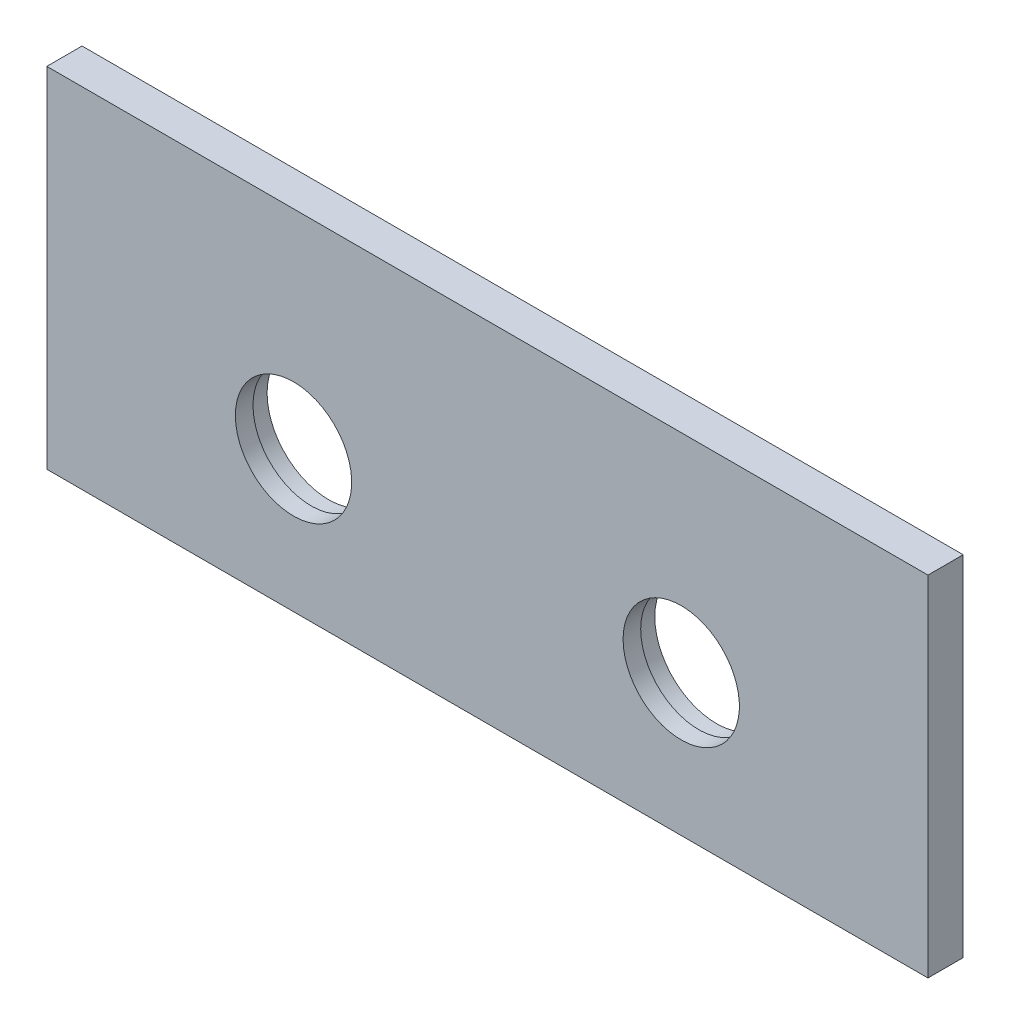
ISO-10303-21;
HEADER;
FILE_DESCRIPTION(('STEP AP214'),'2;1');
FILE_NAME('part.step','',(''),(''),'','','');
FILE_SCHEMA(('AUTOMOTIVE_DESIGN { 1 0 10303 214 1 1 1 1 }'));
ENDSEC;
DATA;
#1=APPLICATION_CONTEXT('core data for automotive mechanical design processes');
#2=APPLICATION_PROTOCOL_DEFINITION('international standard','automotive_design',2000,#1);
#3=PRODUCT_CONTEXT('',#1,'mechanical');
#4=PRODUCT('Part','Part','',(#3));
#5=PRODUCT_RELATED_PRODUCT_CATEGORY('part','',(#4));
#6=PRODUCT_DEFINITION_FORMATION('','',#4);
#7=PRODUCT_DEFINITION_CONTEXT('part definition',#1,'design');
#8=PRODUCT_DEFINITION('design','',#6,#7);
#9=PRODUCT_DEFINITION_SHAPE('','',#8);
#10=(LENGTH_UNIT() NAMED_UNIT(*) SI_UNIT(.MILLI.,.METRE.));
#11=(NAMED_UNIT(*) PLANE_ANGLE_UNIT() SI_UNIT($,.RADIAN.));
#12=(NAMED_UNIT(*) SI_UNIT($,.STERADIAN.) SOLID_ANGLE_UNIT());
#13=UNCERTAINTY_MEASURE_WITH_UNIT(LENGTH_MEASURE(1.E-05),#10,'distance_accuracy_value','');
#14=(GEOMETRIC_REPRESENTATION_CONTEXT(3) GLOBAL_UNCERTAINTY_ASSIGNED_CONTEXT((#13)) GLOBAL_UNIT_ASSIGNED_CONTEXT((#10,
#11,#12)) REPRESENTATION_CONTEXT('',''));
#15=CARTESIAN_POINT('',(0.,0.,0.));
#16=DIRECTION('',(0.,0.,1.));
#17=DIRECTION('',(1.,0.,0.));
#18=AXIS2_PLACEMENT_3D('',#15,#16,#17);
#19=CARTESIAN_POINT('',(-125.,-49.5,10.));
#20=DIRECTION('',(1.,0.,0.));
#21=DIRECTION('',(0.,1.,0.));
#22=AXIS2_PLACEMENT_3D('',#19,#20,#21);
#23=PLANE('',#22);
#24=DIRECTION('',(0.,-1.,0.));
#25=VECTOR('',#24,1.);
#26=CARTESIAN_POINT('',(-125.,-49.5,0.));
#27=LINE('',#26,#25);
#28=CARTESIAN_POINT('',(-125.,49.5,0.));
#29=VERTEX_POINT('',#28);
#30=CARTESIAN_POINT('',(-125.,-49.5,0.));
#31=VERTEX_POINT('',#30);
#32=EDGE_CURVE('E96',#29,#31,#27,.T.);
#33=ORIENTED_EDGE('',*,*,#32,.T.);
#34=DIRECTION('',(0.,0.,-1.));
#35=VECTOR('',#34,1.);
#36=CARTESIAN_POINT('',(-125.,-49.5,10.));
#37=LINE('',#36,#35);
#38=CARTESIAN_POINT('',(-125.,-49.5,10.));
#39=VERTEX_POINT('',#38);
#40=EDGE_CURVE('E11',#39,#31,#37,.T.);
#41=ORIENTED_EDGE('',*,*,#40,.F.);
#42=DIRECTION('',(0.,-1.,0.));
#43=VECTOR('',#42,1.);
#44=CARTESIAN_POINT('',(-125.,-49.5,10.));
#45=LINE('',#44,#43);
#46=CARTESIAN_POINT('',(-125.,49.5,10.));
#47=VERTEX_POINT('',#46);
#48=EDGE_CURVE('E84',#47,#39,#45,.T.);
#49=ORIENTED_EDGE('',*,*,#48,.F.);
#50=DIRECTION('',(0.,0.,-1.));
#51=VECTOR('',#50,1.);
#52=CARTESIAN_POINT('',(-125.,49.5,10.));
#53=LINE('',#52,#51);
#54=EDGE_CURVE('E92',#47,#29,#53,.T.);
#55=ORIENTED_EDGE('',*,*,#54,.T.);
#56=EDGE_LOOP('',(#33,#41,#49,#55));
#57=FACE_BOUND('',#56,.T.);
#58=ADVANCED_FACE('F33',(#57),#23,.F.);
#59=CARTESIAN_POINT('',(-125.,-49.5,10.));
#60=DIRECTION('',(0.,1.,0.));
#61=DIRECTION('',(-1.,0.,0.));
#62=AXIS2_PLACEMENT_3D('',#59,#60,#61);
#63=PLANE('',#62);
#64=DIRECTION('',(1.,0.,0.));
#65=VECTOR('',#64,1.);
#66=CARTESIAN_POINT('',(-125.,-49.5,0.));
#67=LINE('',#66,#65);
#68=CARTESIAN_POINT('',(125.,-49.5,0.));
#69=VERTEX_POINT('',#68);
#70=EDGE_CURVE('E88',#31,#69,#67,.T.);
#71=ORIENTED_EDGE('',*,*,#70,.T.);
#72=DIRECTION('',(0.,0.,-1.));
#73=VECTOR('',#72,1.);
#74=CARTESIAN_POINT('',(125.,-49.5,10.));
#75=LINE('',#74,#73);
#76=CARTESIAN_POINT('',(125.,-49.5,10.));
#77=VERTEX_POINT('',#76);
#78=EDGE_CURVE('E41',#77,#69,#75,.T.);
#79=ORIENTED_EDGE('',*,*,#78,.F.);
#80=DIRECTION('',(1.,0.,0.));
#81=VECTOR('',#80,1.);
#82=CARTESIAN_POINT('',(-125.,-49.5,10.));
#83=LINE('',#82,#81);
#84=EDGE_CURVE('E79',#39,#77,#83,.T.);
#85=ORIENTED_EDGE('',*,*,#84,.F.);
#86=ORIENTED_EDGE('',*,*,#40,.T.);
#87=EDGE_LOOP('',(#71,#79,#85,#86));
#88=FACE_BOUND('',#87,.T.);
#89=ADVANCED_FACE('F87',(#88),#63,.F.);
#90=CARTESIAN_POINT('',(125.,-49.5,10.));
#91=DIRECTION('',(-1.,0.,0.));
#92=DIRECTION('',(0.,-1.,0.));
#93=AXIS2_PLACEMENT_3D('',#90,#91,#92);
#94=PLANE('',#93);
#95=DIRECTION('',(0.,1.,0.));
#96=VECTOR('',#95,1.);
#97=CARTESIAN_POINT('',(125.,-49.5,0.));
#98=LINE('',#97,#96);
#99=CARTESIAN_POINT('',(125.,49.5,0.));
#100=VERTEX_POINT('',#99);
#101=EDGE_CURVE('E66',#69,#100,#98,.T.);
#102=ORIENTED_EDGE('',*,*,#101,.T.);
#103=DIRECTION('',(0.,0.,-1.));
#104=VECTOR('',#103,1.);
#105=CARTESIAN_POINT('',(125.,49.5,10.));
#106=LINE('',#105,#104);
#107=CARTESIAN_POINT('',(125.,49.5,10.));
#108=VERTEX_POINT('',#107);
#109=EDGE_CURVE('E89',#108,#100,#106,.T.);
#110=ORIENTED_EDGE('',*,*,#109,.F.);
#111=DIRECTION('',(0.,1.,0.));
#112=VECTOR('',#111,1.);
#113=CARTESIAN_POINT('',(125.,-49.5,10.));
#114=LINE('',#113,#112);
#115=EDGE_CURVE('E82',#77,#108,#114,.T.);
#116=ORIENTED_EDGE('',*,*,#115,.F.);
#117=ORIENTED_EDGE('',*,*,#78,.T.);
#118=EDGE_LOOP('',(#102,#110,#116,#117));
#119=FACE_BOUND('',#118,.T.);
#120=ADVANCED_FACE('F90',(#119),#94,.F.);
#121=CARTESIAN_POINT('',(-125.,49.5,10.));
#122=DIRECTION('',(0.,-1.,0.));
#123=DIRECTION('',(1.,0.,0.));
#124=AXIS2_PLACEMENT_3D('',#121,#122,#123);
#125=PLANE('',#124);
#126=DIRECTION('',(-1.,0.,0.));
#127=VECTOR('',#126,1.);
#128=CARTESIAN_POINT('',(-125.,49.5,0.));
#129=LINE('',#128,#127);
#130=EDGE_CURVE('E72',#100,#29,#129,.T.);
#131=ORIENTED_EDGE('',*,*,#130,.T.);
#132=ORIENTED_EDGE('',*,*,#54,.F.);
#133=DIRECTION('',(-1.,0.,0.));
#134=VECTOR('',#133,1.);
#135=CARTESIAN_POINT('',(-125.,49.5,10.));
#136=LINE('',#135,#134);
#137=EDGE_CURVE('E49',#108,#47,#136,.T.);
#138=ORIENTED_EDGE('',*,*,#137,.F.);
#139=ORIENTED_EDGE('',*,*,#109,.T.);
#140=EDGE_LOOP('',(#131,#132,#138,#139));
#141=FACE_BOUND('',#140,.T.);
#142=ADVANCED_FACE('F104',(#141),#125,.F.);
#143=CARTESIAN_POINT('',(0.,0.,10.));
#144=DIRECTION('',(0.,0.,-1.));
#145=DIRECTION('',(-1.,0.,0.));
#146=AXIS2_PLACEMENT_3D('',#143,#144,#145);
#147=PLANE('',#146);
#148=CARTESIAN_POINT('',(-55.,-9.5,10.));
#149=DIRECTION('',(0.,0.,-1.));
#150=DIRECTION('',(-1.,0.,0.));
#151=AXIS2_PLACEMENT_3D('',#148,#149,#150);
#152=CIRCLE('',#151,16.5);
#153=CARTESIAN_POINT('',(-71.5,-9.5,10.));
#154=VERTEX_POINT('',#153);
#155=EDGE_CURVE('E121',#154,#154,#152,.T.);
#156=ORIENTED_EDGE('',*,*,#155,.T.);
#157=EDGE_LOOP('',(#156));
#158=FACE_BOUND('',#157,.T.);
#159=CARTESIAN_POINT('',(55.,-9.5,10.));
#160=DIRECTION('',(0.,0.,-1.));
#161=DIRECTION('',(-1.,0.,0.));
#162=AXIS2_PLACEMENT_3D('',#159,#160,#161);
#163=CIRCLE('',#162,16.5);
#164=CARTESIAN_POINT('',(38.5,-9.5,10.));
#165=VERTEX_POINT('',#164);
#166=EDGE_CURVE('E99',#165,#165,#163,.T.);
#167=ORIENTED_EDGE('',*,*,#166,.T.);
#168=EDGE_LOOP('',(#167));
#169=FACE_BOUND('',#168,.T.);
#170=ORIENTED_EDGE('',*,*,#48,.T.);
#171=ORIENTED_EDGE('',*,*,#84,.T.);
#172=ORIENTED_EDGE('',*,*,#115,.T.);
#173=ORIENTED_EDGE('',*,*,#137,.T.);
#174=EDGE_LOOP('',(#170,#171,#172,#173));
#175=FACE_BOUND('',#174,.T.);
#176=ADVANCED_FACE('F80',(#158,#169,#175),#147,.F.);
#177=CARTESIAN_POINT('',(0.,0.,0.));
#178=DIRECTION('',(0.,0.,-1.));
#179=DIRECTION('',(-1.,0.,0.));
#180=AXIS2_PLACEMENT_3D('',#177,#178,#179);
#181=PLANE('',#180);
#182=CARTESIAN_POINT('',(-55.,-9.5,0.));
#183=DIRECTION('',(0.,0.,-1.));
#184=DIRECTION('',(-1.,0.,0.));
#185=AXIS2_PLACEMENT_3D('',#182,#183,#184);
#186=CIRCLE('',#185,17.5);
#187=CARTESIAN_POINT('',(-72.5,-9.5,0.));
#188=VERTEX_POINT('',#187);
#189=EDGE_CURVE('E130',#188,#188,#186,.T.);
#190=ORIENTED_EDGE('',*,*,#189,.F.);
#191=EDGE_LOOP('',(#190));
#192=FACE_BOUND('',#191,.T.);
#193=CARTESIAN_POINT('',(55.,-9.5,0.));
#194=DIRECTION('',(0.,0.,-1.));
#195=DIRECTION('',(-1.,0.,0.));
#196=AXIS2_PLACEMENT_3D('',#193,#194,#195);
#197=CIRCLE('',#196,17.5);
#198=CARTESIAN_POINT('',(37.5,-9.5,0.));
#199=VERTEX_POINT('',#198);
#200=EDGE_CURVE('E118',#199,#199,#197,.T.);
#201=ORIENTED_EDGE('',*,*,#200,.F.);
#202=EDGE_LOOP('',(#201));
#203=FACE_BOUND('',#202,.T.);
#204=ORIENTED_EDGE('',*,*,#32,.F.);
#205=ORIENTED_EDGE('',*,*,#130,.F.);
#206=ORIENTED_EDGE('',*,*,#101,.F.);
#207=ORIENTED_EDGE('',*,*,#70,.F.);
#208=EDGE_LOOP('',(#204,#205,#206,#207));
#209=FACE_BOUND('',#208,.T.);
#210=ADVANCED_FACE('F107',(#192,#203,#209),#181,.T.);
#211=CARTESIAN_POINT('',(55.,-9.5,0.));
#212=DIRECTION('',(0.,0.,-1.));
#213=DIRECTION('',(-1.,0.,0.));
#214=AXIS2_PLACEMENT_3D('',#211,#212,#213);
#215=CYLINDRICAL_SURFACE('',#214,16.5);
#216=ORIENTED_EDGE('',*,*,#166,.F.);
#217=EDGE_LOOP('',(#216));
#218=FACE_BOUND('',#217,.T.);
#219=CARTESIAN_POINT('',(55.,-9.5,5.));
#220=DIRECTION('',(0.,0.,-1.));
#221=DIRECTION('',(-1.,0.,0.));
#222=AXIS2_PLACEMENT_3D('',#219,#220,#221);
#223=CIRCLE('',#222,16.5);
#224=CARTESIAN_POINT('',(38.5,-9.5,5.));
#225=VERTEX_POINT('',#224);
#226=EDGE_CURVE('E112',#225,#225,#223,.T.);
#227=ORIENTED_EDGE('',*,*,#226,.T.);
#228=EDGE_LOOP('',(#227));
#229=FACE_BOUND('',#228,.T.);
#230=ADVANCED_FACE('F138',(#218,#229),#215,.F.);
#231=CARTESIAN_POINT('',(71.5,-9.5,5.));
#232=DIRECTION('',(0.,0.,1.));
#233=DIRECTION('',(1.,0.,0.));
#234=AXIS2_PLACEMENT_3D('',#231,#232,#233);
#235=PLANE('',#234);
#236=ORIENTED_EDGE('',*,*,#226,.F.);
#237=EDGE_LOOP('',(#236));
#238=FACE_BOUND('',#237,.T.);
#239=CARTESIAN_POINT('',(55.,-9.5,5.));
#240=DIRECTION('',(0.,0.,-1.));
#241=DIRECTION('',(-1.,0.,0.));
#242=AXIS2_PLACEMENT_3D('',#239,#240,#241);
#243=CIRCLE('',#242,17.5);
#244=CARTESIAN_POINT('',(37.5,-9.5,5.));
#245=VERTEX_POINT('',#244);
#246=EDGE_CURVE('E115',#245,#245,#243,.T.);
#247=ORIENTED_EDGE('',*,*,#246,.T.);
#248=EDGE_LOOP('',(#247));
#249=FACE_BOUND('',#248,.T.);
#250=ADVANCED_FACE('F145',(#238,#249),#235,.F.);
#251=CARTESIAN_POINT('',(55.,-9.5,0.));
#252=DIRECTION('',(0.,0.,-1.));
#253=DIRECTION('',(-1.,0.,0.));
#254=AXIS2_PLACEMENT_3D('',#251,#252,#253);
#255=CYLINDRICAL_SURFACE('',#254,17.5);
#256=ORIENTED_EDGE('',*,*,#246,.F.);
#257=EDGE_LOOP('',(#256));
#258=FACE_BOUND('',#257,.T.);
#259=ORIENTED_EDGE('',*,*,#200,.T.);
#260=EDGE_LOOP('',(#259));
#261=FACE_BOUND('',#260,.T.);
#262=ADVANCED_FACE('F142',(#258,#261),#255,.F.);
#263=CARTESIAN_POINT('',(-55.,-9.5,0.));
#264=DIRECTION('',(0.,0.,-1.));
#265=DIRECTION('',(-1.,0.,0.));
#266=AXIS2_PLACEMENT_3D('',#263,#264,#265);
#267=CYLINDRICAL_SURFACE('',#266,16.5);
#268=ORIENTED_EDGE('',*,*,#155,.F.);
#269=EDGE_LOOP('',(#268));
#270=FACE_BOUND('',#269,.T.);
#271=CARTESIAN_POINT('',(-55.,-9.5,5.));
#272=DIRECTION('',(0.,0.,-1.));
#273=DIRECTION('',(-1.,0.,0.));
#274=AXIS2_PLACEMENT_3D('',#271,#272,#273);
#275=CIRCLE('',#274,16.5);
#276=CARTESIAN_POINT('',(-71.5,-9.5,5.));
#277=VERTEX_POINT('',#276);
#278=EDGE_CURVE('E124',#277,#277,#275,.T.);
#279=ORIENTED_EDGE('',*,*,#278,.T.);
#280=EDGE_LOOP('',(#279));
#281=FACE_BOUND('',#280,.T.);
#282=ADVANCED_FACE('F144',(#270,#281),#267,.F.);
#283=CARTESIAN_POINT('',(-38.5,-9.5,5.));
#284=DIRECTION('',(0.,0.,1.));
#285=DIRECTION('',(1.,0.,0.));
#286=AXIS2_PLACEMENT_3D('',#283,#284,#285);
#287=PLANE('',#286);
#288=ORIENTED_EDGE('',*,*,#278,.F.);
#289=EDGE_LOOP('',(#288));
#290=FACE_BOUND('',#289,.T.);
#291=CARTESIAN_POINT('',(-55.,-9.5,5.));
#292=DIRECTION('',(0.,0.,-1.));
#293=DIRECTION('',(-1.,0.,0.));
#294=AXIS2_PLACEMENT_3D('',#291,#292,#293);
#295=CIRCLE('',#294,17.5);
#296=CARTESIAN_POINT('',(-72.5,-9.5,5.));
#297=VERTEX_POINT('',#296);
#298=EDGE_CURVE('E127',#297,#297,#295,.T.);
#299=ORIENTED_EDGE('',*,*,#298,.T.);
#300=EDGE_LOOP('',(#299));
#301=FACE_BOUND('',#300,.T.);
#302=ADVANCED_FACE('F152',(#290,#301),#287,.F.);
#303=CARTESIAN_POINT('',(-55.,-9.5,0.));
#304=DIRECTION('',(0.,0.,-1.));
#305=DIRECTION('',(-1.,0.,0.));
#306=AXIS2_PLACEMENT_3D('',#303,#304,#305);
#307=CYLINDRICAL_SURFACE('',#306,17.5);
#308=ORIENTED_EDGE('',*,*,#298,.F.);
#309=EDGE_LOOP('',(#308));
#310=FACE_BOUND('',#309,.T.);
#311=ORIENTED_EDGE('',*,*,#189,.T.);
#312=EDGE_LOOP('',(#311));
#313=FACE_BOUND('',#312,.T.);
#314=ADVANCED_FACE('F134',(#310,#313),#307,.F.);
#315=CLOSED_SHELL('',(#58,#89,#120,#142,#176,#210,#230,#250,#262,#282,#302,#314));
#316=MANIFOLD_SOLID_BREP('B2',#315);
#317=ADVANCED_BREP_SHAPE_REPRESENTATION('',(#18,#316),#14);
#318=SHAPE_DEFINITION_REPRESENTATION(#9,#317);
ENDSEC;
END-ISO-10303-21;
